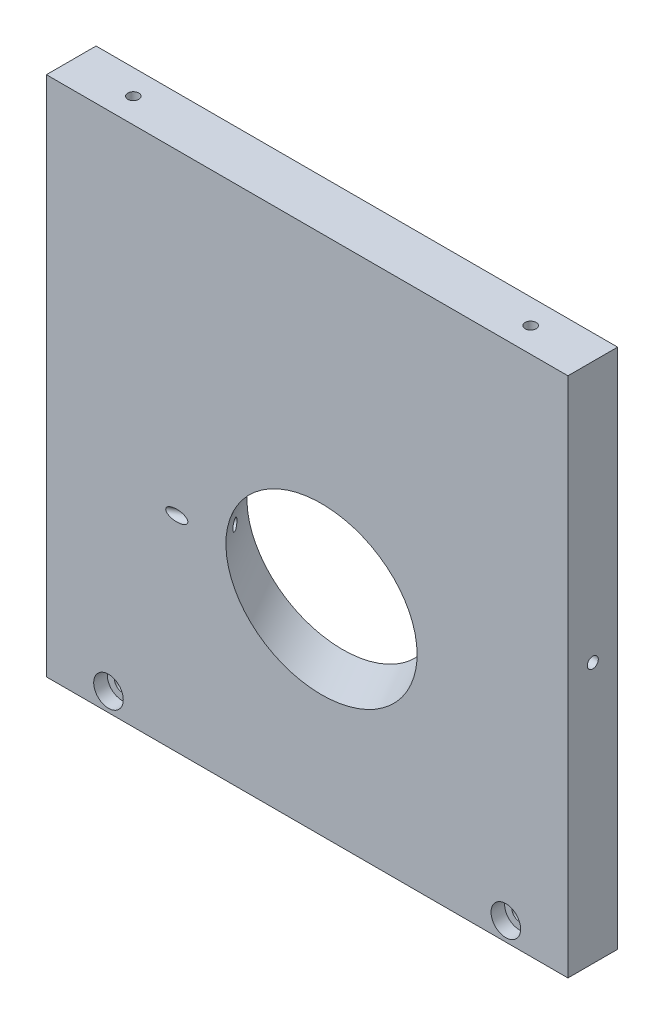
ISO-10303-21;
HEADER;
FILE_DESCRIPTION(('STEP AP214'),'2;1');
FILE_NAME('part.step','',(''),(''),'','','');
FILE_SCHEMA(('AUTOMOTIVE_DESIGN { 1 0 10303 214 1 1 1 1 }'));
ENDSEC;
DATA;
#1=APPLICATION_CONTEXT('core data for automotive mechanical design processes');
#2=APPLICATION_PROTOCOL_DEFINITION('international standard','automotive_design',2000,#1);
#3=PRODUCT_CONTEXT('',#1,'mechanical');
#4=PRODUCT('Part','Part','',(#3));
#5=PRODUCT_RELATED_PRODUCT_CATEGORY('part','',(#4));
#6=PRODUCT_DEFINITION_FORMATION('','',#4);
#7=PRODUCT_DEFINITION_CONTEXT('part definition',#1,'design');
#8=PRODUCT_DEFINITION('design','',#6,#7);
#9=PRODUCT_DEFINITION_SHAPE('','',#8);
#10=(LENGTH_UNIT() NAMED_UNIT(*) SI_UNIT(.MILLI.,.METRE.));
#11=(NAMED_UNIT(*) PLANE_ANGLE_UNIT() SI_UNIT($,.RADIAN.));
#12=(NAMED_UNIT(*) SI_UNIT($,.STERADIAN.) SOLID_ANGLE_UNIT());
#13=UNCERTAINTY_MEASURE_WITH_UNIT(LENGTH_MEASURE(1.E-05),#10,'distance_accuracy_value','');
#14=(GEOMETRIC_REPRESENTATION_CONTEXT(3) GLOBAL_UNCERTAINTY_ASSIGNED_CONTEXT((#13)) GLOBAL_UNIT_ASSIGNED_CONTEXT((#10,
#11,#12)) REPRESENTATION_CONTEXT('',''));
#15=CARTESIAN_POINT('',(0.,0.,0.));
#16=DIRECTION('',(0.,0.,1.));
#17=DIRECTION('',(1.,0.,0.));
#18=AXIS2_PLACEMENT_3D('',#15,#16,#17);
#19=CARTESIAN_POINT('',(42.,42.,8.));
#20=DIRECTION('',(-1.,0.,0.));
#21=DIRECTION('',(0.,0.,1.));
#22=AXIS2_PLACEMENT_3D('',#19,#20,#21);
#23=PLANE('',#22);
#24=CARTESIAN_POINT('',(42.,0.,4.));
#25=DIRECTION('',(1.,0.,0.));
#26=DIRECTION('',(0.,0.,-1.));
#27=AXIS2_PLACEMENT_3D('',#24,#25,#26);
#28=CIRCLE('',#27,0.888999999999989);
#29=CARTESIAN_POINT('',(42.,0.,3.11100000000001));
#30=VERTEX_POINT('',#29);
#31=EDGE_CURVE('E146',#30,#30,#28,.T.);
#32=ORIENTED_EDGE('',*,*,#31,.F.);
#33=EDGE_LOOP('',(#32));
#34=FACE_BOUND('',#33,.T.);
#35=DIRECTION('',(0.,1.,0.));
#36=VECTOR('',#35,1.);
#37=CARTESIAN_POINT('',(42.,42.,0.));
#38=LINE('',#37,#36);
#39=CARTESIAN_POINT('',(42.,-42.,0.));
#40=VERTEX_POINT('',#39);
#41=CARTESIAN_POINT('',(42.,42.,0.));
#42=VERTEX_POINT('',#41);
#43=EDGE_CURVE('E186',#40,#42,#38,.T.);
#44=ORIENTED_EDGE('',*,*,#43,.T.);
#45=DIRECTION('',(0.,0.,-1.));
#46=VECTOR('',#45,1.);
#47=CARTESIAN_POINT('',(42.,42.,8.));
#48=LINE('',#47,#46);
#49=CARTESIAN_POINT('',(42.,42.,8.));
#50=VERTEX_POINT('',#49);
#51=EDGE_CURVE('E12',#50,#42,#48,.T.);
#52=ORIENTED_EDGE('',*,*,#51,.F.);
#53=DIRECTION('',(0.,1.,0.));
#54=VECTOR('',#53,1.);
#55=CARTESIAN_POINT('',(42.,42.,8.));
#56=LINE('',#55,#54);
#57=CARTESIAN_POINT('',(42.,-42.,8.));
#58=VERTEX_POINT('',#57);
#59=EDGE_CURVE('E187',#58,#50,#56,.T.);
#60=ORIENTED_EDGE('',*,*,#59,.F.);
#61=DIRECTION('',(0.,0.,-1.));
#62=VECTOR('',#61,1.);
#63=CARTESIAN_POINT('',(42.,-42.,8.));
#64=LINE('',#63,#62);
#65=EDGE_CURVE('E197',#58,#40,#64,.T.);
#66=ORIENTED_EDGE('',*,*,#65,.T.);
#67=EDGE_LOOP('',(#44,#52,#60,#66));
#68=FACE_BOUND('',#67,.T.);
#69=ADVANCED_FACE('F48',(#34,#68),#23,.F.);
#70=CARTESIAN_POINT('',(-42.,42.,8.));
#71=DIRECTION('',(0.,-1.,0.));
#72=DIRECTION('',(0.,0.,-1.));
#73=AXIS2_PLACEMENT_3D('',#70,#71,#72);
#74=PLANE('',#73);
#75=CARTESIAN_POINT('',(-32.,42.,4.));
#76=DIRECTION('',(0.,1.,0.));
#77=DIRECTION('',(0.,0.,1.));
#78=AXIS2_PLACEMENT_3D('',#75,#76,#77);
#79=CIRCLE('',#78,0.888999999999987);
#80=CARTESIAN_POINT('',(-32.,42.,4.88899999999999));
#81=VERTEX_POINT('',#80);
#82=EDGE_CURVE('E125',#81,#81,#79,.T.);
#83=ORIENTED_EDGE('',*,*,#82,.F.);
#84=EDGE_LOOP('',(#83));
#85=FACE_BOUND('',#84,.T.);
#86=CARTESIAN_POINT('',(32.,42.,4.00000000000001));
#87=DIRECTION('',(0.,1.,0.));
#88=DIRECTION('',(0.,0.,1.));
#89=AXIS2_PLACEMENT_3D('',#86,#87,#88);
#90=CIRCLE('',#89,0.888999999999987);
#91=CARTESIAN_POINT('',(32.,42.,4.889));
#92=VERTEX_POINT('',#91);
#93=EDGE_CURVE('E124',#92,#92,#90,.T.);
#94=ORIENTED_EDGE('',*,*,#93,.F.);
#95=EDGE_LOOP('',(#94));
#96=FACE_BOUND('',#95,.T.);
#97=DIRECTION('',(-1.,0.,0.));
#98=VECTOR('',#97,1.);
#99=CARTESIAN_POINT('',(-42.,42.,0.));
#100=LINE('',#99,#98);
#101=CARTESIAN_POINT('',(-42.,42.,0.));
#102=VERTEX_POINT('',#101);
#103=EDGE_CURVE('E201',#42,#102,#100,.T.);
#104=ORIENTED_EDGE('',*,*,#103,.T.);
#105=DIRECTION('',(0.,0.,-1.));
#106=VECTOR('',#105,1.);
#107=CARTESIAN_POINT('',(-42.,42.,8.));
#108=LINE('',#107,#106);
#109=CARTESIAN_POINT('',(-42.,42.,8.));
#110=VERTEX_POINT('',#109);
#111=EDGE_CURVE('E60',#110,#102,#108,.T.);
#112=ORIENTED_EDGE('',*,*,#111,.F.);
#113=DIRECTION('',(-1.,0.,0.));
#114=VECTOR('',#113,1.);
#115=CARTESIAN_POINT('',(-42.,42.,8.));
#116=LINE('',#115,#114);
#117=EDGE_CURVE('E100',#50,#110,#116,.T.);
#118=ORIENTED_EDGE('',*,*,#117,.F.);
#119=ORIENTED_EDGE('',*,*,#51,.T.);
#120=EDGE_LOOP('',(#104,#112,#118,#119));
#121=FACE_BOUND('',#120,.T.);
#122=ADVANCED_FACE('F235',(#85,#96,#121),#74,.F.);
#123=CARTESIAN_POINT('',(-42.,42.,8.));
#124=DIRECTION('',(1.,0.,0.));
#125=DIRECTION('',(0.,0.,-1.));
#126=AXIS2_PLACEMENT_3D('',#123,#124,#125);
#127=PLANE('',#126);
#128=CARTESIAN_POINT('',(-42.,0.,4.));
#129=DIRECTION('',(-1.,0.,0.));
#130=DIRECTION('',(0.,0.,1.));
#131=AXIS2_PLACEMENT_3D('',#128,#129,#130);
#132=CIRCLE('',#131,0.888999999999989);
#133=CARTESIAN_POINT('',(-42.,0.,4.88899999999999));
#134=VERTEX_POINT('',#133);
#135=EDGE_CURVE('E138',#134,#134,#132,.T.);
#136=ORIENTED_EDGE('',*,*,#135,.F.);
#137=EDGE_LOOP('',(#136));
#138=FACE_BOUND('',#137,.T.);
#139=DIRECTION('',(0.,-1.,0.));
#140=VECTOR('',#139,1.);
#141=CARTESIAN_POINT('',(-42.,42.,0.));
#142=LINE('',#141,#140);
#143=CARTESIAN_POINT('',(-42.,-42.,0.));
#144=VERTEX_POINT('',#143);
#145=EDGE_CURVE('E87',#102,#144,#142,.T.);
#146=ORIENTED_EDGE('',*,*,#145,.T.);
#147=DIRECTION('',(0.,0.,-1.));
#148=VECTOR('',#147,1.);
#149=CARTESIAN_POINT('',(-42.,-42.,8.));
#150=LINE('',#149,#148);
#151=CARTESIAN_POINT('',(-42.,-42.,8.));
#152=VERTEX_POINT('',#151);
#153=EDGE_CURVE('E210',#152,#144,#150,.T.);
#154=ORIENTED_EDGE('',*,*,#153,.F.);
#155=DIRECTION('',(0.,-1.,0.));
#156=VECTOR('',#155,1.);
#157=CARTESIAN_POINT('',(-42.,42.,8.));
#158=LINE('',#157,#156);
#159=EDGE_CURVE('E192',#110,#152,#158,.T.);
#160=ORIENTED_EDGE('',*,*,#159,.F.);
#161=ORIENTED_EDGE('',*,*,#111,.T.);
#162=EDGE_LOOP('',(#146,#154,#160,#161));
#163=FACE_BOUND('',#162,.T.);
#164=ADVANCED_FACE('F239',(#138,#163),#127,.F.);
#165=CARTESIAN_POINT('',(-42.,-42.,8.));
#166=DIRECTION('',(0.,1.,0.));
#167=DIRECTION('',(0.,0.,1.));
#168=AXIS2_PLACEMENT_3D('',#165,#166,#167);
#169=PLANE('',#168);
#170=DIRECTION('',(1.,0.,0.));
#171=VECTOR('',#170,1.);
#172=CARTESIAN_POINT('',(-42.,-42.,0.));
#173=LINE('',#172,#171);
#174=EDGE_CURVE('E93',#144,#40,#173,.T.);
#175=ORIENTED_EDGE('',*,*,#174,.T.);
#176=ORIENTED_EDGE('',*,*,#65,.F.);
#177=DIRECTION('',(1.,0.,0.));
#178=VECTOR('',#177,1.);
#179=CARTESIAN_POINT('',(-42.,-42.,8.));
#180=LINE('',#179,#178);
#181=EDGE_CURVE('E69',#152,#58,#180,.T.);
#182=ORIENTED_EDGE('',*,*,#181,.F.);
#183=ORIENTED_EDGE('',*,*,#153,.T.);
#184=EDGE_LOOP('',(#175,#176,#182,#183));
#185=FACE_BOUND('',#184,.T.);
#186=ADVANCED_FACE('F243',(#185),#169,.F.);
#187=CARTESIAN_POINT('',(0.,0.,8.));
#188=DIRECTION('',(0.,0.,1.));
#189=DIRECTION('',(1.,0.,0.));
#190=AXIS2_PLACEMENT_3D('',#187,#188,#189);
#191=PLANE('',#190);
#192=CARTESIAN_POINT('',(2.30940107675851,-9.00000000000001,8.));
#193=DIRECTION('',(0.,0.,1.));
#194=DIRECTION('',(1.,0.,0.));
#195=AXIS2_PLACEMENT_3D('',#192,#193,#194);
#196=ELLIPSE('',#195,15.3979316792873,13.335);
#197=CARTESIAN_POINT('',(17.7073327560458,-9.00000000000001,8.));
#198=VERTEX_POINT('',#197);
#199=EDGE_CURVE('E215',#198,#198,#196,.T.);
#200=ORIENTED_EDGE('',*,*,#199,.F.);
#201=EDGE_LOOP('',(#200));
#202=FACE_BOUND('',#201,.T.);
#203=CARTESIAN_POINT('',(-21.,-9.00000000000001,8.));
#204=DIRECTION('',(0.,0.,1.));
#205=DIRECTION('',(-1.,0.,0.));
#206=AXIS2_PLACEMENT_3D('',#203,#204,#205);
#207=ELLIPSE('',#206,1.77799999999999,0.888999999999992);
#208=CARTESIAN_POINT('',(-22.778,-9.00000000000001,8.));
#209=VERTEX_POINT('',#208);
#210=EDGE_CURVE('E53',#209,#209,#207,.T.);
#211=ORIENTED_EDGE('',*,*,#210,.F.);
#212=EDGE_LOOP('',(#211));
#213=FACE_BOUND('',#212,.T.);
#214=CARTESIAN_POINT('',(-32.,-39.,8.));
#215=DIRECTION('',(0.,0.,1.));
#216=DIRECTION('',(1.,0.,0.));
#217=AXIS2_PLACEMENT_3D('',#214,#215,#216);
#218=CIRCLE('',#217,2.38124999999999);
#219=CARTESIAN_POINT('',(-29.61875,-39.,8.));
#220=VERTEX_POINT('',#219);
#221=EDGE_CURVE('E154',#220,#220,#218,.T.);
#222=ORIENTED_EDGE('',*,*,#221,.F.);
#223=EDGE_LOOP('',(#222));
#224=FACE_BOUND('',#223,.T.);
#225=CARTESIAN_POINT('',(32.,-39.,8.));
#226=DIRECTION('',(0.,0.,1.));
#227=DIRECTION('',(1.,0.,0.));
#228=AXIS2_PLACEMENT_3D('',#225,#226,#227);
#229=CIRCLE('',#228,2.38124999999999);
#230=CARTESIAN_POINT('',(34.38125,-39.,8.));
#231=VERTEX_POINT('',#230);
#232=EDGE_CURVE('E170',#231,#231,#229,.T.);
#233=ORIENTED_EDGE('',*,*,#232,.F.);
#234=EDGE_LOOP('',(#233));
#235=FACE_BOUND('',#234,.T.);
#236=ORIENTED_EDGE('',*,*,#59,.T.);
#237=ORIENTED_EDGE('',*,*,#117,.T.);
#238=ORIENTED_EDGE('',*,*,#159,.T.);
#239=ORIENTED_EDGE('',*,*,#181,.T.);
#240=EDGE_LOOP('',(#236,#237,#238,#239));
#241=FACE_BOUND('',#240,.T.);
#242=ADVANCED_FACE('F247',(#202,#213,#224,#235,#241),#191,.T.);
#243=CARTESIAN_POINT('',(0.,0.,0.));
#244=DIRECTION('',(0.,0.,1.));
#245=DIRECTION('',(1.,0.,0.));
#246=AXIS2_PLACEMENT_3D('',#243,#244,#245);
#247=PLANE('',#246);
#248=CARTESIAN_POINT('',(-2.30940107675851,-9.00000000000001,0.));
#249=DIRECTION('',(0.,0.,1.));
#250=DIRECTION('',(1.,0.,0.));
#251=AXIS2_PLACEMENT_3D('',#248,#249,#250);
#252=ELLIPSE('',#251,15.3979316792873,13.335);
#253=CARTESIAN_POINT('',(13.0885306025288,-9.00000000000001,0.));
#254=VERTEX_POINT('',#253);
#255=EDGE_CURVE('E219',#254,#254,#252,.T.);
#256=ORIENTED_EDGE('',*,*,#255,.T.);
#257=EDGE_LOOP('',(#256));
#258=FACE_BOUND('',#257,.T.);
#259=CARTESIAN_POINT('',(-32.,-39.,0.));
#260=DIRECTION('',(0.,0.,1.));
#261=DIRECTION('',(1.,0.,0.));
#262=AXIS2_PLACEMENT_3D('',#259,#260,#261);
#263=CIRCLE('',#262,1.2192);
#264=CARTESIAN_POINT('',(-30.7808,-39.,0.));
#265=VERTEX_POINT('',#264);
#266=EDGE_CURVE('E166',#265,#265,#263,.T.);
#267=ORIENTED_EDGE('',*,*,#266,.T.);
#268=EDGE_LOOP('',(#267));
#269=FACE_BOUND('',#268,.T.);
#270=CARTESIAN_POINT('',(32.,-39.,0.));
#271=DIRECTION('',(0.,0.,1.));
#272=DIRECTION('',(1.,0.,0.));
#273=AXIS2_PLACEMENT_3D('',#270,#271,#272);
#274=CIRCLE('',#273,1.2192);
#275=CARTESIAN_POINT('',(33.2192,-39.,0.));
#276=VERTEX_POINT('',#275);
#277=EDGE_CURVE('E182',#276,#276,#274,.T.);
#278=ORIENTED_EDGE('',*,*,#277,.T.);
#279=EDGE_LOOP('',(#278));
#280=FACE_BOUND('',#279,.T.);
#281=ORIENTED_EDGE('',*,*,#43,.F.);
#282=ORIENTED_EDGE('',*,*,#174,.F.);
#283=ORIENTED_EDGE('',*,*,#145,.F.);
#284=ORIENTED_EDGE('',*,*,#103,.F.);
#285=EDGE_LOOP('',(#281,#282,#283,#284));
#286=FACE_BOUND('',#285,.T.);
#287=ADVANCED_FACE('F248',(#258,#269,#280,#286),#247,.F.);
#288=CARTESIAN_POINT('',(32.,-39.,8.));
#289=DIRECTION('',(0.,0.,1.));
#290=DIRECTION('',(1.,0.,0.));
#291=AXIS2_PLACEMENT_3D('',#288,#289,#290);
#292=CYLINDRICAL_SURFACE('',#291,1.2192);
#293=ORIENTED_EDGE('',*,*,#277,.F.);
#294=EDGE_LOOP('',(#293));
#295=FACE_BOUND('',#294,.T.);
#296=CARTESIAN_POINT('',(32.,-39.,5.8156));
#297=DIRECTION('',(0.,0.,1.));
#298=DIRECTION('',(1.,0.,0.));
#299=AXIS2_PLACEMENT_3D('',#296,#297,#298);
#300=CIRCLE('',#299,1.2192);
#301=CARTESIAN_POINT('',(33.2192,-39.,5.8156));
#302=VERTEX_POINT('',#301);
#303=EDGE_CURVE('E178',#302,#302,#300,.T.);
#304=ORIENTED_EDGE('',*,*,#303,.T.);
#305=EDGE_LOOP('',(#304));
#306=FACE_BOUND('',#305,.T.);
#307=ADVANCED_FACE('F251',(#295,#306),#292,.F.);
#308=CARTESIAN_POINT('',(33.2192,-39.,5.8156));
#309=DIRECTION('',(0.,0.,-1.));
#310=DIRECTION('',(-1.,0.,0.));
#311=AXIS2_PLACEMENT_3D('',#308,#309,#310);
#312=PLANE('',#311);
#313=ORIENTED_EDGE('',*,*,#303,.F.);
#314=EDGE_LOOP('',(#313));
#315=FACE_BOUND('',#314,.T.);
#316=CARTESIAN_POINT('',(32.,-39.,5.8156));
#317=DIRECTION('',(0.,0.,1.));
#318=DIRECTION('',(1.,0.,0.));
#319=AXIS2_PLACEMENT_3D('',#316,#317,#318);
#320=CIRCLE('',#319,2.38124999999999);
#321=CARTESIAN_POINT('',(34.38125,-39.,5.8156));
#322=VERTEX_POINT('',#321);
#323=EDGE_CURVE('E174',#322,#322,#320,.T.);
#324=ORIENTED_EDGE('',*,*,#323,.T.);
#325=EDGE_LOOP('',(#324));
#326=FACE_BOUND('',#325,.T.);
#327=ADVANCED_FACE('F258',(#315,#326),#312,.F.);
#328=CARTESIAN_POINT('',(32.,-39.,8.));
#329=DIRECTION('',(0.,0.,1.));
#330=DIRECTION('',(1.,0.,0.));
#331=AXIS2_PLACEMENT_3D('',#328,#329,#330);
#332=CYLINDRICAL_SURFACE('',#331,2.38124999999999);
#333=ORIENTED_EDGE('',*,*,#323,.F.);
#334=EDGE_LOOP('',(#333));
#335=FACE_BOUND('',#334,.T.);
#336=ORIENTED_EDGE('',*,*,#232,.T.);
#337=EDGE_LOOP('',(#336));
#338=FACE_BOUND('',#337,.T.);
#339=ADVANCED_FACE('F262',(#335,#338),#332,.F.);
#340=CARTESIAN_POINT('',(-32.,-39.,8.));
#341=DIRECTION('',(0.,0.,1.));
#342=DIRECTION('',(1.,0.,0.));
#343=AXIS2_PLACEMENT_3D('',#340,#341,#342);
#344=CYLINDRICAL_SURFACE('',#343,1.2192);
#345=ORIENTED_EDGE('',*,*,#266,.F.);
#346=EDGE_LOOP('',(#345));
#347=FACE_BOUND('',#346,.T.);
#348=CARTESIAN_POINT('',(-32.,-39.,5.8156));
#349=DIRECTION('',(0.,0.,1.));
#350=DIRECTION('',(1.,0.,0.));
#351=AXIS2_PLACEMENT_3D('',#348,#349,#350);
#352=CIRCLE('',#351,1.2192);
#353=CARTESIAN_POINT('',(-30.7808,-39.,5.8156));
#354=VERTEX_POINT('',#353);
#355=EDGE_CURVE('E162',#354,#354,#352,.T.);
#356=ORIENTED_EDGE('',*,*,#355,.T.);
#357=EDGE_LOOP('',(#356));
#358=FACE_BOUND('',#357,.T.);
#359=ADVANCED_FACE('F266',(#347,#358),#344,.F.);
#360=CARTESIAN_POINT('',(-30.7808,-39.,5.8156));
#361=DIRECTION('',(0.,0.,-1.));
#362=DIRECTION('',(-1.,0.,0.));
#363=AXIS2_PLACEMENT_3D('',#360,#361,#362);
#364=PLANE('',#363);
#365=ORIENTED_EDGE('',*,*,#355,.F.);
#366=EDGE_LOOP('',(#365));
#367=FACE_BOUND('',#366,.T.);
#368=CARTESIAN_POINT('',(-32.,-39.,5.8156));
#369=DIRECTION('',(0.,0.,1.));
#370=DIRECTION('',(1.,0.,0.));
#371=AXIS2_PLACEMENT_3D('',#368,#369,#370);
#372=CIRCLE('',#371,2.38124999999999);
#373=CARTESIAN_POINT('',(-29.61875,-39.,5.8156));
#374=VERTEX_POINT('',#373);
#375=EDGE_CURVE('E158',#374,#374,#372,.T.);
#376=ORIENTED_EDGE('',*,*,#375,.T.);
#377=EDGE_LOOP('',(#376));
#378=FACE_BOUND('',#377,.T.);
#379=ADVANCED_FACE('F270',(#367,#378),#364,.F.);
#380=CARTESIAN_POINT('',(-32.,-39.,8.));
#381=DIRECTION('',(0.,0.,1.));
#382=DIRECTION('',(1.,0.,0.));
#383=AXIS2_PLACEMENT_3D('',#380,#381,#382);
#384=CYLINDRICAL_SURFACE('',#383,2.38124999999999);
#385=ORIENTED_EDGE('',*,*,#375,.F.);
#386=EDGE_LOOP('',(#385));
#387=FACE_BOUND('',#386,.T.);
#388=ORIENTED_EDGE('',*,*,#221,.T.);
#389=EDGE_LOOP('',(#388));
#390=FACE_BOUND('',#389,.T.);
#391=ADVANCED_FACE('F274',(#387,#390),#384,.F.);
#392=CARTESIAN_POINT('',(30.,0.,4.));
#393=DIRECTION('',(1.,0.,0.));
#394=DIRECTION('',(0.,0.,-1.));
#395=AXIS2_PLACEMENT_3D('',#392,#393,#394);
#396=CONICAL_SURFACE('',#395,0.888999999999998,1.02974425867665);
#397=CARTESIAN_POINT('',(29.4658349096845,0.,4.));
#398=VERTEX_POINT('',#397);
#399=VERTEX_LOOP('',#398);
#400=FACE_BOUND('',#399,.T.);
#401=CARTESIAN_POINT('',(30.,0.,4.));
#402=DIRECTION('',(1.,0.,0.));
#403=DIRECTION('',(0.,0.,-1.));
#404=AXIS2_PLACEMENT_3D('',#401,#402,#403);
#405=CIRCLE('',#404,0.888999999999998);
#406=CARTESIAN_POINT('',(30.,0.,3.111));
#407=VERTEX_POINT('',#406);
#408=EDGE_CURVE('E150',#407,#407,#405,.T.);
#409=ORIENTED_EDGE('',*,*,#408,.T.);
#410=EDGE_LOOP('',(#409));
#411=FACE_BOUND('',#410,.T.);
#412=ADVANCED_FACE('F278',(#400,#411),#396,.F.);
#413=CARTESIAN_POINT('',(42.,0.,4.));
#414=DIRECTION('',(1.,0.,0.));
#415=DIRECTION('',(0.,0.,-1.));
#416=AXIS2_PLACEMENT_3D('',#413,#414,#415);
#417=CYLINDRICAL_SURFACE('',#416,0.888999999999993);
#418=ORIENTED_EDGE('',*,*,#408,.F.);
#419=EDGE_LOOP('',(#418));
#420=FACE_BOUND('',#419,.T.);
#421=ORIENTED_EDGE('',*,*,#31,.T.);
#422=EDGE_LOOP('',(#421));
#423=FACE_BOUND('',#422,.T.);
#424=ADVANCED_FACE('F282',(#420,#423),#417,.F.);
#425=CARTESIAN_POINT('',(-30.,0.,4.));
#426=DIRECTION('',(-1.,0.,0.));
#427=DIRECTION('',(0.,0.,1.));
#428=AXIS2_PLACEMENT_3D('',#425,#426,#427);
#429=CONICAL_SURFACE('',#428,0.888999999999997,1.02974425867665);
#430=CARTESIAN_POINT('',(-29.4658349096845,0.,4.));
#431=VERTEX_POINT('',#430);
#432=VERTEX_LOOP('',#431);
#433=FACE_BOUND('',#432,.T.);
#434=CARTESIAN_POINT('',(-30.,0.,4.));
#435=DIRECTION('',(-1.,0.,0.));
#436=DIRECTION('',(0.,0.,1.));
#437=AXIS2_PLACEMENT_3D('',#434,#435,#436);
#438=CIRCLE('',#437,0.888999999999997);
#439=CARTESIAN_POINT('',(-30.,0.,4.889));
#440=VERTEX_POINT('',#439);
#441=EDGE_CURVE('E142',#440,#440,#438,.T.);
#442=ORIENTED_EDGE('',*,*,#441,.T.);
#443=EDGE_LOOP('',(#442));
#444=FACE_BOUND('',#443,.T.);
#445=ADVANCED_FACE('F286',(#433,#444),#429,.F.);
#446=CARTESIAN_POINT('',(-42.,0.,4.));
#447=DIRECTION('',(-1.,0.,0.));
#448=DIRECTION('',(0.,0.,1.));
#449=AXIS2_PLACEMENT_3D('',#446,#447,#448);
#450=CYLINDRICAL_SURFACE('',#449,0.888999999999993);
#451=ORIENTED_EDGE('',*,*,#441,.F.);
#452=EDGE_LOOP('',(#451));
#453=FACE_BOUND('',#452,.T.);
#454=ORIENTED_EDGE('',*,*,#135,.T.);
#455=EDGE_LOOP('',(#454));
#456=FACE_BOUND('',#455,.T.);
#457=ADVANCED_FACE('F290',(#453,#456),#450,.F.);
#458=CARTESIAN_POINT('',(32.,30.,4.00000000000001));
#459=DIRECTION('',(0.,1.,0.));
#460=DIRECTION('',(0.,0.,1.));
#461=AXIS2_PLACEMENT_3D('',#458,#459,#460);
#462=CONICAL_SURFACE('',#461,0.888999999999994,1.02974425867665);
#463=CARTESIAN_POINT('',(32.,29.4658349096845,4.00000000000001));
#464=VERTEX_POINT('',#463);
#465=VERTEX_LOOP('',#464);
#466=FACE_BOUND('',#465,.T.);
#467=CARTESIAN_POINT('',(32.,30.,4.00000000000001));
#468=DIRECTION('',(0.,1.,0.));
#469=DIRECTION('',(0.,0.,1.));
#470=AXIS2_PLACEMENT_3D('',#467,#468,#469);
#471=CIRCLE('',#470,0.888999999999994);
#472=CARTESIAN_POINT('',(32.,30.,4.88900000000001));
#473=VERTEX_POINT('',#472);
#474=EDGE_CURVE('E130',#473,#473,#471,.T.);
#475=ORIENTED_EDGE('',*,*,#474,.T.);
#476=EDGE_LOOP('',(#475));
#477=FACE_BOUND('',#476,.T.);
#478=ADVANCED_FACE('F294',(#466,#477),#462,.F.);
#479=CARTESIAN_POINT('',(32.,42.,4.00000000000001));
#480=DIRECTION('',(0.,1.,0.));
#481=DIRECTION('',(0.,0.,1.));
#482=AXIS2_PLACEMENT_3D('',#479,#480,#481);
#483=CYLINDRICAL_SURFACE('',#482,0.88899999999999);
#484=ORIENTED_EDGE('',*,*,#474,.F.);
#485=EDGE_LOOP('',(#484));
#486=FACE_BOUND('',#485,.T.);
#487=ORIENTED_EDGE('',*,*,#93,.T.);
#488=EDGE_LOOP('',(#487));
#489=FACE_BOUND('',#488,.T.);
#490=ADVANCED_FACE('F117',(#486,#489),#483,.F.);
#491=CARTESIAN_POINT('',(-32.,30.,4.));
#492=DIRECTION('',(0.,1.,0.));
#493=DIRECTION('',(0.,0.,1.));
#494=AXIS2_PLACEMENT_3D('',#491,#492,#493);
#495=CONICAL_SURFACE('',#494,0.888999999999997,1.02974425867665);
#496=CARTESIAN_POINT('',(-32.,29.4658349096845,4.));
#497=VERTEX_POINT('',#496);
#498=VERTEX_LOOP('',#497);
#499=FACE_BOUND('',#498,.T.);
#500=CARTESIAN_POINT('',(-32.,30.,4.));
#501=DIRECTION('',(0.,1.,0.));
#502=DIRECTION('',(0.,0.,1.));
#503=AXIS2_PLACEMENT_3D('',#500,#501,#502);
#504=CIRCLE('',#503,0.888999999999997);
#505=CARTESIAN_POINT('',(-32.,30.,4.889));
#506=VERTEX_POINT('',#505);
#507=EDGE_CURVE('E121',#506,#506,#504,.T.);
#508=ORIENTED_EDGE('',*,*,#507,.T.);
#509=EDGE_LOOP('',(#508));
#510=FACE_BOUND('',#509,.T.);
#511=ADVANCED_FACE('F113',(#499,#510),#495,.F.);
#512=CARTESIAN_POINT('',(-32.,42.,4.));
#513=DIRECTION('',(0.,1.,0.));
#514=DIRECTION('',(0.,0.,1.));
#515=AXIS2_PLACEMENT_3D('',#512,#513,#514);
#516=CYLINDRICAL_SURFACE('',#515,0.888999999999992);
#517=ORIENTED_EDGE('',*,*,#507,.F.);
#518=EDGE_LOOP('',(#517));
#519=FACE_BOUND('',#518,.T.);
#520=ORIENTED_EDGE('',*,*,#82,.T.);
#521=EDGE_LOOP('',(#520));
#522=FACE_BOUND('',#521,.T.);
#523=ADVANCED_FACE('F116',(#519,#522),#516,.F.);
#524=CARTESIAN_POINT('',(-20.25,-9.00000000000001,7.56698729810778));
#525=DIRECTION('',(-0.86602540378444,0.,0.499999999999998));
#526=DIRECTION('',(0.499999999999998,0.,0.86602540378444));
#527=AXIS2_PLACEMENT_3D('',#524,#525,#526);
#528=CYLINDRICAL_SURFACE('',#527,0.888999999999992);
#529=CARTESIAN_POINT('',(-15.0040342598795,-8.11405998633449,4.62332587912265));
#530=CARTESIAN_POINT('',(-14.9794106532928,-8.11819857557248,4.666526813196));
#531=CARTESIAN_POINT('',(-14.9551867446311,-8.12653600300431,4.70959380527057));
#532=CARTESIAN_POINT('',(-14.9082033939289,-8.151385588509,4.79418666966478));
#533=CARTESIAN_POINT('',(-14.885445694508,-8.16790727833729,4.83571068420115));
#534=CARTESIAN_POINT('',(-14.8419934198526,-8.20864455186567,4.9159406322547));
#535=CARTESIAN_POINT('',(-14.8212977312537,-8.2328559536734,4.95464808347205));
#536=CARTESIAN_POINT('',(-14.7824423103944,-8.2882808485266,5.02810332515755));
#537=CARTESIAN_POINT('',(-14.7642819989802,-8.31949273819715,5.06285201958604));
#538=CARTESIAN_POINT('',(-14.7308566162375,-8.38809237124382,5.12740272972892));
#539=CARTESIAN_POINT('',(-14.7155959501805,-8.42548935260679,5.1571972103384));
#540=CARTESIAN_POINT('',(-14.6883126070194,-8.50537130104268,5.21086264178205));
#541=CARTESIAN_POINT('',(-14.676290053451,-8.54785646214307,5.23473336661906));
#542=CARTESIAN_POINT('',(-14.6557114191967,-8.63672589502966,5.27581310991509));
#543=CARTESIAN_POINT('',(-14.6471563482335,-8.68311129781572,5.29302018787139));
#544=CARTESIAN_POINT('',(-14.6336759753403,-8.77845354512586,5.32021907503282));
#545=CARTESIAN_POINT('',(-14.6287506218025,-8.82741035307866,5.33021098682438));
#546=CARTESIAN_POINT('',(-14.6226239950611,-8.92640940173163,5.34264954485467));
#547=CARTESIAN_POINT('',(-14.6214158863378,-8.97644947952593,5.34511004032464));
#548=CARTESIAN_POINT('',(-14.6227258790938,-9.07627797874691,5.34244635419729));
#549=CARTESIAN_POINT('',(-14.6252439459578,-9.12606640250709,5.33732224305914));
#550=CARTESIAN_POINT('',(-14.6339564325238,-9.22392101124917,5.3196630693171));
#551=CARTESIAN_POINT('',(-14.6401467447356,-9.27198905691604,5.30713628683021));
#552=CARTESIAN_POINT('',(-14.6560886138873,-9.36510228532649,5.27507463051041));
#553=CARTESIAN_POINT('',(-14.6658402072895,-9.41014743711449,5.25553968492425));
#554=CARTESIAN_POINT('',(-14.6887388309693,-9.49600318842079,5.2100413585723));
#555=CARTESIAN_POINT('',(-14.7018904065856,-9.53680801599833,5.18406937424855));
#556=CARTESIAN_POINT('',(-14.7313267083679,-9.61296458634451,5.12651215686002));
#557=CARTESIAN_POINT('',(-14.7476114699782,-9.64831626741609,5.09492686029477));
#558=CARTESIAN_POINT('',(-14.7830088200209,-9.7126252094334,5.02704576758302));
#559=CARTESIAN_POINT('',(-14.8021262179183,-9.74157138201447,4.99074197314631));
#560=CARTESIAN_POINT('',(-14.8427444881257,-9.79216943736328,4.91456022555773));
#561=CARTESIAN_POINT('',(-14.8642453507239,-9.81382134985159,4.87468228696961));
#562=CARTESIAN_POINT('',(-14.9091048698437,-9.84920159529898,4.79256268513516));
#563=CARTESIAN_POINT('',(-14.9324624301229,-9.86293456484545,4.75032242097106));
#564=CARTESIAN_POINT('',(-14.9804476629556,-9.88210137410299,4.66469615987853));
#565=CARTESIAN_POINT('',(-15.005075318121,-9.88753532739934,4.62131017863933));
#566=CARTESIAN_POINT('',(-15.0548758467929,-9.88994505841362,4.53473122632497));
#567=CARTESIAN_POINT('',(-15.0800475426555,-9.88693758250821,4.49153804312884));
#568=CARTESIAN_POINT('',(-15.1302531343051,-9.87258712108586,4.4064769236716));
#569=CARTESIAN_POINT('',(-15.1552870303152,-9.86124414907156,4.36460898526385));
#570=CARTESIAN_POINT('',(-15.2044456112668,-9.83055260253899,4.28336520282668));
#571=CARTESIAN_POINT('',(-15.2285705497793,-9.81120627902181,4.24398866166104));
#572=CARTESIAN_POINT('',(-15.2751500324548,-9.76505930397321,4.16877462253837));
#573=CARTESIAN_POINT('',(-15.2976045557014,-9.73825855911913,4.13293716889515));
#574=CARTESIAN_POINT('',(-15.3401396480083,-9.67790460027677,4.06568263111227));
#575=CARTESIAN_POINT('',(-15.3602157270019,-9.6443389280021,4.03427388696607));
#576=CARTESIAN_POINT('',(-15.3972562779297,-9.57143434497535,3.97677106891636));
#577=CARTESIAN_POINT('',(-15.414220725554,-9.53209538912332,3.95067703653432));
#578=CARTESIAN_POINT('',(-15.4444547301323,-9.44870774485961,3.9044474702246));
#579=CARTESIAN_POINT('',(-15.457720201828,-9.40465392290677,3.88431852278566));
#580=CARTESIAN_POINT('',(-15.4800488508598,-9.31312036823673,3.85057252307187));
#581=CARTESIAN_POINT('',(-15.4891120726831,-9.26564067179374,3.83695540185946));
#582=CARTESIAN_POINT('',(-15.5026907954832,-9.16867173637931,3.81659430519947));
#583=CARTESIAN_POINT('',(-15.5072125057017,-9.11918533764436,3.80984094533483));
#584=CARTESIAN_POINT('',(-15.5115603908655,-9.01955071738106,3.80334670621541));
#585=CARTESIAN_POINT('',(-15.5113866113787,-8.9694025022801,3.80360575890792));
#586=CARTESIAN_POINT('',(-15.5063545054234,-8.86995802639321,3.81112311413741));
#587=CARTESIAN_POINT('',(-15.5015041386038,-8.82066046287996,3.81836952404891));
#588=CARTESIAN_POINT('',(-15.4873116655571,-8.72422735822638,3.83966017600241));
#589=CARTESIAN_POINT('',(-15.4779695321135,-8.67709183018813,3.85370445923402));
#590=CARTESIAN_POINT('',(-15.4551303901528,-8.58628595961972,3.88824554094552));
#591=CARTESIAN_POINT('',(-15.4416307532062,-8.54261783125676,3.90874642155911));
#592=CARTESIAN_POINT('',(-15.4109666676666,-8.4600115291935,3.95567585543516));
#593=CARTESIAN_POINT('',(-15.3938023062414,-8.42107324302563,3.98210426770849));
#594=CARTESIAN_POINT('',(-15.3563777152449,-8.34895280149031,4.04026714314882));
#595=CARTESIAN_POINT('',(-15.3361117517848,-8.31578155527871,4.07201144417884));
#596=CARTESIAN_POINT('',(-15.2931965099778,-8.25621580205712,4.13995544080381));
#597=CARTESIAN_POINT('',(-15.2705466607558,-8.22982292350905,4.17615620395248));
#598=CARTESIAN_POINT('',(-15.2236052022742,-8.18455885063674,4.25206982453657));
#599=CARTESIAN_POINT('',(-15.1993124191193,-8.1656931023781,4.29178519958896));
#600=CARTESIAN_POINT('',(-15.1498944061118,-8.1360690023589,4.37359984273238));
#601=CARTESIAN_POINT('',(-15.1247701870985,-8.12530115793067,4.41569625721409));
#602=CARTESIAN_POINT('',(-15.0835936026839,-8.1145335994991,4.48558915340744));
#603=CARTESIAN_POINT('',(-15.067555558669,-8.11204495084586,4.51303516491469));
#604=CARTESIAN_POINT('',(-15.0356354675121,-8.11048715641846,4.56811427253474));
#605=CARTESIAN_POINT('',(-15.0197534200422,-8.11141800345313,4.59574736825399));
#606=CARTESIAN_POINT('',(-15.0040342598795,-8.11405998633449,4.62332587912265));
#607=B_SPLINE_CURVE_WITH_KNOTS('',3,(#529,#530,#531,#532,#533,#534,#535,#536,#537,#538,#539,
#540,#541,#542,#543,#544,#545,#546,#547,#548,#549,#550,#551,#552,#553,#554,#555,#556,#557,#558,
#559,#560,#561,#562,#563,#564,#565,#566,#567,#568,#569,#570,#571,#572,#573,#574,#575,#576,#577,
#578,#579,#580,#581,#582,#583,#584,#585,#586,#587,#588,#589,#590,#591,#592,#593,#594,#595,#596,
#597,#598,#599,#600,#601,#602,#603,#604,#605,#606),.UNSPECIFIED.,.T.,.F.,(4,2,2,2,2,2,2,2,2,2,2,
2,2,2,2,2,2,2,2,2,2,2,2,2,2,2,2,2,2,2,2,2,2,2,2,2,2,2,4),(0.,0.149576455015501,
0.299327524435223,0.448997293848729,0.598632818200533,0.748493889027507,0.898360676324565,
1.0482710731676,1.19817933851765,1.34781177722685,1.49744282589549,1.6469068235511,
1.79637235154123,1.94603873840949,2.09570681848339,2.24563199178664,2.39555655421043,
2.54539324556071,2.69522788613853,2.84476549018544,2.99430285199742,3.14379818389757,
3.29329538742922,3.44307046281327,3.59284670827822,3.74278772172129,3.8927271477759,
4.04246129356949,4.19219398625255,4.34167227983475,4.49115147914593,4.6407253758898,
4.79029571532566,4.94014598009287,5.09003221187647,5.24002669426125,5.38984507221534,
5.48533153920683,5.58081780539115),.UNSPECIFIED.);
#608=CARTESIAN_POINT('',(-15.0040342598795,-8.11405998633449,4.62332587912265));
#609=VERTEX_POINT('',#608);
#610=EDGE_CURVE('E222',#609,#609,#607,.T.);
#611=ORIENTED_EDGE('',*,*,#610,.T.);
#612=EDGE_LOOP('',(#611));
#613=FACE_BOUND('',#612,.T.);
#614=ORIENTED_EDGE('',*,*,#210,.T.);
#615=EDGE_LOOP('',(#614));
#616=FACE_BOUND('',#615,.T.);
#617=ADVANCED_FACE('F50',(#613,#616),#528,.F.);
#618=CARTESIAN_POINT('',(2.,-9.00000000000001,7.46410161513775));
#619=DIRECTION('',(0.500000000000001,0.,0.866025403784438));
#620=DIRECTION('',(0.866025403784438,0.,-0.500000000000001));
#621=AXIS2_PLACEMENT_3D('',#618,#619,#620);
#622=CYLINDRICAL_SURFACE('',#621,13.335);
#623=ORIENTED_EDGE('',*,*,#199,.T.);
#624=EDGE_LOOP('',(#623));
#625=FACE_BOUND('',#624,.T.);
#626=ORIENTED_EDGE('',*,*,#255,.F.);
#627=EDGE_LOOP('',(#626));
#628=FACE_BOUND('',#627,.T.);
#629=ORIENTED_EDGE('',*,*,#610,.F.);
#630=EDGE_LOOP('',(#629));
#631=FACE_BOUND('',#630,.T.);
#632=ADVANCED_FACE('F228',(#625,#628,#631),#622,.F.);
#633=CLOSED_SHELL('',(#69,#122,#164,#186,#242,#287,#307,#327,#339,#359,#379,#391,#412,#424,#445,
#457,#478,#490,#511,#523,#617,#632));
#634=MANIFOLD_SOLID_BREP('B2',#633);
#635=ADVANCED_BREP_SHAPE_REPRESENTATION('',(#18,#634),#14);
#636=SHAPE_DEFINITION_REPRESENTATION(#9,#635);
ENDSEC;
END-ISO-10303-21;
